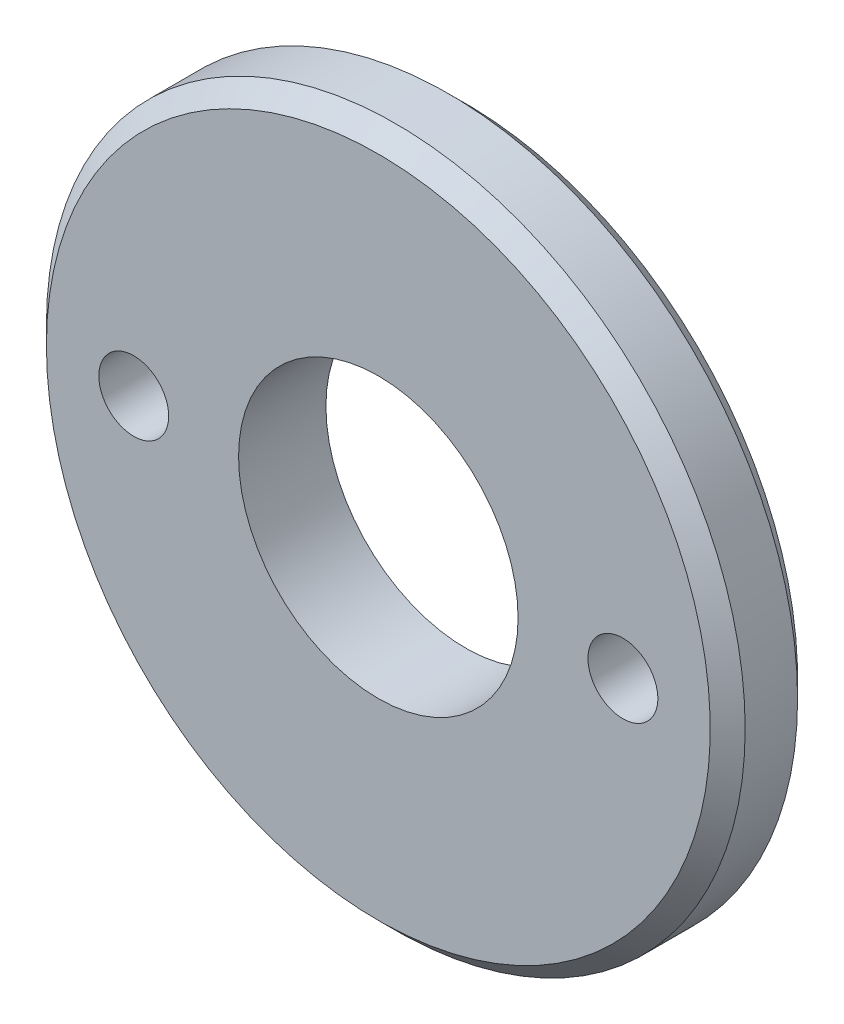
ISO-10303-21;
HEADER;
FILE_DESCRIPTION(('STEP AP214'),'2;1');
FILE_NAME('part.step','',(''),(''),'','','');
FILE_SCHEMA(('AUTOMOTIVE_DESIGN { 1 0 10303 214 1 1 1 1 }'));
ENDSEC;
DATA;
#1=APPLICATION_CONTEXT('core data for automotive mechanical design processes');
#2=APPLICATION_PROTOCOL_DEFINITION('international standard','automotive_design',2000,#1);
#3=PRODUCT_CONTEXT('',#1,'mechanical');
#4=PRODUCT('Part','Part','',(#3));
#5=PRODUCT_RELATED_PRODUCT_CATEGORY('part','',(#4));
#6=PRODUCT_DEFINITION_FORMATION('','',#4);
#7=PRODUCT_DEFINITION_CONTEXT('part definition',#1,'design');
#8=PRODUCT_DEFINITION('design','',#6,#7);
#9=PRODUCT_DEFINITION_SHAPE('','',#8);
#10=(LENGTH_UNIT() NAMED_UNIT(*) SI_UNIT(.MILLI.,.METRE.));
#11=(NAMED_UNIT(*) PLANE_ANGLE_UNIT() SI_UNIT($,.RADIAN.));
#12=(NAMED_UNIT(*) SI_UNIT($,.STERADIAN.) SOLID_ANGLE_UNIT());
#13=UNCERTAINTY_MEASURE_WITH_UNIT(LENGTH_MEASURE(1.E-05),#10,'distance_accuracy_value','');
#14=(GEOMETRIC_REPRESENTATION_CONTEXT(3) GLOBAL_UNCERTAINTY_ASSIGNED_CONTEXT((#13)) GLOBAL_UNIT_ASSIGNED_CONTEXT((#10,
#11,#12)) REPRESENTATION_CONTEXT('',''));
#15=CARTESIAN_POINT('',(0.,0.,0.));
#16=DIRECTION('',(0.,0.,1.));
#17=DIRECTION('',(1.,0.,0.));
#18=AXIS2_PLACEMENT_3D('',#15,#16,#17);
#19=CARTESIAN_POINT('',(0.,0.,2.5));
#20=DIRECTION('',(0.,0.,-1.));
#21=DIRECTION('',(-1.,0.,0.));
#22=AXIS2_PLACEMENT_3D('',#19,#20,#21);
#23=CYLINDRICAL_SURFACE('',#22,8.);
#24=CARTESIAN_POINT('',(0.,0.,-5.));
#25=DIRECTION('',(0.,0.,-1.));
#26=DIRECTION('',(-1.,0.,0.));
#27=AXIS2_PLACEMENT_3D('',#24,#25,#26);
#28=CIRCLE('',#27,8.);
#29=CARTESIAN_POINT('',(-8.,0.,-5.));
#30=VERTEX_POINT('',#29);
#31=EDGE_CURVE('E48',#30,#30,#28,.T.);
#32=ORIENTED_EDGE('',*,*,#31,.T.);
#33=EDGE_LOOP('',(#32));
#34=FACE_BOUND('',#33,.T.);
#35=CARTESIAN_POINT('',(0.,0.,0.));
#36=DIRECTION('',(0.,0.,1.));
#37=DIRECTION('',(1.,0.,0.));
#38=AXIS2_PLACEMENT_3D('',#35,#36,#37);
#39=CIRCLE('',#38,8.);
#40=CARTESIAN_POINT('',(8.,0.,0.));
#41=VERTEX_POINT('',#40);
#42=EDGE_CURVE('E46',#41,#41,#39,.T.);
#43=ORIENTED_EDGE('',*,*,#42,.T.);
#44=EDGE_LOOP('',(#43));
#45=FACE_BOUND('',#44,.T.);
#46=ADVANCED_FACE('F29',(#34,#45),#23,.F.);
#47=CARTESIAN_POINT('',(0.,0.,0.));
#48=DIRECTION('',(0.,0.,-1.));
#49=DIRECTION('',(-1.,0.,0.));
#50=AXIS2_PLACEMENT_3D('',#47,#48,#49);
#51=PLANE('',#50);
#52=CARTESIAN_POINT('',(14.,0.,0.));
#53=DIRECTION('',(0.,0.,-1.));
#54=DIRECTION('',(-1.,0.,0.));
#55=AXIS2_PLACEMENT_3D('',#52,#53,#54);
#56=CIRCLE('',#55,2.);
#57=CARTESIAN_POINT('',(12.,0.,0.));
#58=VERTEX_POINT('',#57);
#59=EDGE_CURVE('E33',#58,#58,#56,.T.);
#60=ORIENTED_EDGE('',*,*,#59,.T.);
#61=EDGE_LOOP('',(#60));
#62=FACE_BOUND('',#61,.T.);
#63=CARTESIAN_POINT('',(-14.,0.,0.));
#64=DIRECTION('',(0.,0.,-1.));
#65=DIRECTION('',(-1.,0.,0.));
#66=AXIS2_PLACEMENT_3D('',#63,#64,#65);
#67=CIRCLE('',#66,2.);
#68=CARTESIAN_POINT('',(-16.,0.,0.));
#69=VERTEX_POINT('',#68);
#70=EDGE_CURVE('E49',#69,#69,#67,.T.);
#71=ORIENTED_EDGE('',*,*,#70,.T.);
#72=EDGE_LOOP('',(#71));
#73=FACE_BOUND('',#72,.T.);
#74=CARTESIAN_POINT('',(0.,0.,0.));
#75=DIRECTION('',(0.,0.,-1.));
#76=DIRECTION('',(-1.,0.,0.));
#77=AXIS2_PLACEMENT_3D('',#74,#75,#76);
#78=CIRCLE('',#77,19.);
#79=CARTESIAN_POINT('',(-19.,0.,0.));
#80=VERTEX_POINT('',#79);
#81=EDGE_CURVE('E37',#80,#80,#78,.F.);
#82=ORIENTED_EDGE('',*,*,#81,.T.);
#83=EDGE_LOOP('',(#82));
#84=FACE_BOUND('',#83,.T.);
#85=ORIENTED_EDGE('',*,*,#42,.F.);
#86=EDGE_LOOP('',(#85));
#87=FACE_BOUND('',#86,.T.);
#88=ADVANCED_FACE('F86',(#62,#73,#84,#87),#51,.F.);
#89=CARTESIAN_POINT('',(0.,0.,-5.));
#90=DIRECTION('',(0.,0.,-1.));
#91=DIRECTION('',(-1.,0.,0.));
#92=AXIS2_PLACEMENT_3D('',#89,#90,#91);
#93=PLANE('',#92);
#94=CARTESIAN_POINT('',(0.,0.,-5.));
#95=DIRECTION('',(0.,0.,-1.));
#96=DIRECTION('',(-1.,0.,0.));
#97=AXIS2_PLACEMENT_3D('',#94,#95,#96);
#98=CIRCLE('',#97,19.);
#99=CARTESIAN_POINT('',(-19.,0.,-5.));
#100=VERTEX_POINT('',#99);
#101=EDGE_CURVE('E10',#100,#100,#98,.T.);
#102=ORIENTED_EDGE('',*,*,#101,.T.);
#103=EDGE_LOOP('',(#102));
#104=FACE_BOUND('',#103,.T.);
#105=ORIENTED_EDGE('',*,*,#31,.F.);
#106=EDGE_LOOP('',(#105));
#107=FACE_BOUND('',#106,.T.);
#108=ADVANCED_FACE('F81',(#104,#107),#93,.T.);
#109=CARTESIAN_POINT('',(0.,0.,-5.));
#110=DIRECTION('',(0.,0.,1.));
#111=DIRECTION('',(1.,0.,0.));
#112=AXIS2_PLACEMENT_3D('',#109,#110,#111);
#113=CYLINDRICAL_SURFACE('',#112,20.);
#114=CARTESIAN_POINT('',(0.,0.,-1.));
#115=DIRECTION('',(0.,0.,-1.));
#116=DIRECTION('',(-1.,0.,0.));
#117=AXIS2_PLACEMENT_3D('',#114,#115,#116);
#118=CIRCLE('',#117,20.);
#119=CARTESIAN_POINT('',(-20.,0.,-1.));
#120=VERTEX_POINT('',#119);
#121=EDGE_CURVE('E42',#120,#120,#118,.T.);
#122=ORIENTED_EDGE('',*,*,#121,.T.);
#123=EDGE_LOOP('',(#122));
#124=FACE_BOUND('',#123,.T.);
#125=CARTESIAN_POINT('',(0.,0.,-3.99999999999999));
#126=DIRECTION('',(0.,0.,-1.));
#127=DIRECTION('',(-1.,0.,0.));
#128=AXIS2_PLACEMENT_3D('',#125,#126,#127);
#129=CIRCLE('',#128,20.);
#130=CARTESIAN_POINT('',(-20.,0.,-3.99999999999999));
#131=VERTEX_POINT('',#130);
#132=EDGE_CURVE('E64',#131,#131,#129,.F.);
#133=ORIENTED_EDGE('',*,*,#132,.T.);
#134=EDGE_LOOP('',(#133));
#135=FACE_BOUND('',#134,.T.);
#136=ADVANCED_FACE('F69',(#124,#135),#113,.T.);
#137=CARTESIAN_POINT('',(0.,0.,-1.));
#138=DIRECTION('',(0.,0.,-1.));
#139=DIRECTION('',(-1.,0.,0.));
#140=AXIS2_PLACEMENT_3D('',#137,#138,#139);
#141=CONICAL_SURFACE('',#140,20.,0.785398163397452);
#142=ORIENTED_EDGE('',*,*,#81,.F.);
#143=EDGE_LOOP('',(#142));
#144=FACE_BOUND('',#143,.T.);
#145=ORIENTED_EDGE('',*,*,#121,.F.);
#146=EDGE_LOOP('',(#145));
#147=FACE_BOUND('',#146,.T.);
#148=ADVANCED_FACE('F72',(#144,#147),#141,.T.);
#149=CARTESIAN_POINT('',(0.,0.,-5.));
#150=DIRECTION('',(0.,0.,1.));
#151=DIRECTION('',(1.,0.,0.));
#152=AXIS2_PLACEMENT_3D('',#149,#150,#151);
#153=CONICAL_SURFACE('',#152,19.,0.785398163397448);
#154=ORIENTED_EDGE('',*,*,#132,.F.);
#155=EDGE_LOOP('',(#154));
#156=FACE_BOUND('',#155,.T.);
#157=ORIENTED_EDGE('',*,*,#101,.F.);
#158=EDGE_LOOP('',(#157));
#159=FACE_BOUND('',#158,.T.);
#160=ADVANCED_FACE('F31',(#156,#159),#153,.T.);
#161=CARTESIAN_POINT('',(-14.,0.,2.));
#162=DIRECTION('',(0.,0.,-1.));
#163=DIRECTION('',(-1.,0.,0.));
#164=AXIS2_PLACEMENT_3D('',#161,#162,#163);
#165=CYLINDRICAL_SURFACE('',#164,2.);
#166=CARTESIAN_POINT('',(-14.,0.,-3.));
#167=DIRECTION('',(0.,0.,-1.));
#168=DIRECTION('',(-1.,0.,0.));
#169=AXIS2_PLACEMENT_3D('',#166,#167,#168);
#170=CIRCLE('',#169,2.);
#171=CARTESIAN_POINT('',(-16.,0.,-3.));
#172=VERTEX_POINT('',#171);
#173=EDGE_CURVE('E51',#172,#172,#170,.T.);
#174=ORIENTED_EDGE('',*,*,#173,.T.);
#175=EDGE_LOOP('',(#174));
#176=FACE_BOUND('',#175,.T.);
#177=ORIENTED_EDGE('',*,*,#70,.F.);
#178=EDGE_LOOP('',(#177));
#179=FACE_BOUND('',#178,.T.);
#180=ADVANCED_FACE('F79',(#176,#179),#165,.F.);
#181=CARTESIAN_POINT('',(-14.,0.,-3.));
#182=DIRECTION('',(0.,0.,-1.));
#183=DIRECTION('',(-1.,0.,0.));
#184=AXIS2_PLACEMENT_3D('',#181,#182,#183);
#185=PLANE('',#184);
#186=ORIENTED_EDGE('',*,*,#173,.F.);
#187=EDGE_LOOP('',(#186));
#188=FACE_BOUND('',#187,.T.);
#189=ADVANCED_FACE('F99',(#188),#185,.F.);
#190=CARTESIAN_POINT('',(14.,0.,2.));
#191=DIRECTION('',(0.,0.,-1.));
#192=DIRECTION('',(-1.,0.,0.));
#193=AXIS2_PLACEMENT_3D('',#190,#191,#192);
#194=CYLINDRICAL_SURFACE('',#193,2.);
#195=CARTESIAN_POINT('',(14.,0.,-3.));
#196=DIRECTION('',(0.,0.,-1.));
#197=DIRECTION('',(-1.,0.,0.));
#198=AXIS2_PLACEMENT_3D('',#195,#196,#197);
#199=CIRCLE('',#198,2.);
#200=CARTESIAN_POINT('',(12.,0.,-3.));
#201=VERTEX_POINT('',#200);
#202=EDGE_CURVE('E59',#201,#201,#199,.T.);
#203=ORIENTED_EDGE('',*,*,#202,.T.);
#204=EDGE_LOOP('',(#203));
#205=FACE_BOUND('',#204,.T.);
#206=ORIENTED_EDGE('',*,*,#59,.F.);
#207=EDGE_LOOP('',(#206));
#208=FACE_BOUND('',#207,.T.);
#209=ADVANCED_FACE('F102',(#205,#208),#194,.F.);
#210=CARTESIAN_POINT('',(14.,0.,-3.));
#211=DIRECTION('',(0.,0.,-1.));
#212=DIRECTION('',(-1.,0.,0.));
#213=AXIS2_PLACEMENT_3D('',#210,#211,#212);
#214=PLANE('',#213);
#215=ORIENTED_EDGE('',*,*,#202,.F.);
#216=EDGE_LOOP('',(#215));
#217=FACE_BOUND('',#216,.T.);
#218=ADVANCED_FACE('F106',(#217),#214,.F.);
#219=CLOSED_SHELL('',(#46,#88,#108,#136,#148,#160,#180,#189,#209,#218));
#220=MANIFOLD_SOLID_BREP('B2',#219);
#221=ADVANCED_BREP_SHAPE_REPRESENTATION('',(#18,#220),#14);
#222=SHAPE_DEFINITION_REPRESENTATION(#9,#221);
ENDSEC;
END-ISO-10303-21;
